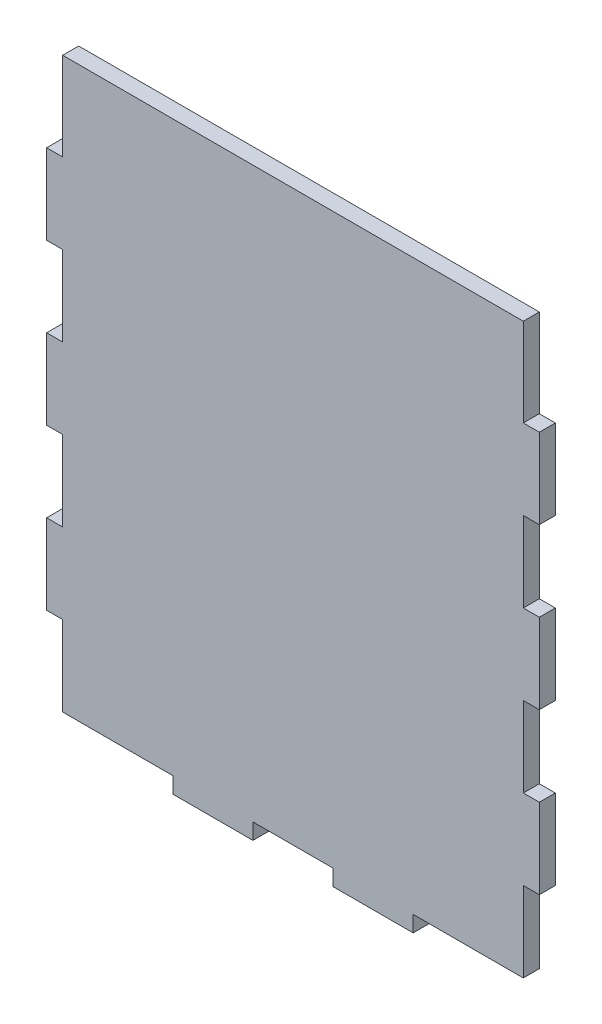
ISO-10303-21;
HEADER;
FILE_DESCRIPTION(('STEP AP214'),'2;1');
FILE_NAME('part.step','',(''),(''),'','','');
FILE_SCHEMA(('AUTOMOTIVE_DESIGN { 1 0 10303 214 1 1 1 1 }'));
ENDSEC;
DATA;
#1=APPLICATION_CONTEXT('core data for automotive mechanical design processes');
#2=APPLICATION_PROTOCOL_DEFINITION('international standard','automotive_design',2000,#1);
#3=PRODUCT_CONTEXT('',#1,'mechanical');
#4=PRODUCT('Part','Part','',(#3));
#5=PRODUCT_RELATED_PRODUCT_CATEGORY('part','',(#4));
#6=PRODUCT_DEFINITION_FORMATION('','',#4);
#7=PRODUCT_DEFINITION_CONTEXT('part definition',#1,'design');
#8=PRODUCT_DEFINITION('design','',#6,#7);
#9=PRODUCT_DEFINITION_SHAPE('','',#8);
#10=(LENGTH_UNIT() NAMED_UNIT(*) SI_UNIT(.MILLI.,.METRE.));
#11=(NAMED_UNIT(*) PLANE_ANGLE_UNIT() SI_UNIT($,.RADIAN.));
#12=(NAMED_UNIT(*) SI_UNIT($,.STERADIAN.) SOLID_ANGLE_UNIT());
#13=UNCERTAINTY_MEASURE_WITH_UNIT(LENGTH_MEASURE(1.E-05),#10,'distance_accuracy_value','');
#14=(GEOMETRIC_REPRESENTATION_CONTEXT(3) GLOBAL_UNCERTAINTY_ASSIGNED_CONTEXT((#13)) GLOBAL_UNIT_ASSIGNED_CONTEXT((#10,
#11,#12)) REPRESENTATION_CONTEXT('',''));
#15=CARTESIAN_POINT('',(0.,0.,0.));
#16=DIRECTION('',(0.,0.,1.));
#17=DIRECTION('',(1.,0.,0.));
#18=AXIS2_PLACEMENT_3D('',#15,#16,#17);
#19=CARTESIAN_POINT('',(0.,0.,4.));
#20=DIRECTION('',(1.,0.,0.));
#21=DIRECTION('',(0.,0.,-1.));
#22=AXIS2_PLACEMENT_3D('',#19,#20,#21);
#23=PLANE('',#22);
#24=DIRECTION('',(0.,-1.,0.));
#25=VECTOR('',#24,1.);
#26=CARTESIAN_POINT('',(0.,0.,0.));
#27=LINE('',#26,#25);
#28=CARTESIAN_POINT('',(0.,20.,0.));
#29=VERTEX_POINT('',#28);
#30=CARTESIAN_POINT('',(0.,0.,0.));
#31=VERTEX_POINT('',#30);
#32=EDGE_CURVE('E308',#29,#31,#27,.T.);
#33=ORIENTED_EDGE('',*,*,#32,.T.);
#34=DIRECTION('',(0.,0.,-1.));
#35=VECTOR('',#34,1.);
#36=CARTESIAN_POINT('',(0.,0.,4.));
#37=LINE('',#36,#35);
#38=CARTESIAN_POINT('',(0.,0.,4.));
#39=VERTEX_POINT('',#38);
#40=EDGE_CURVE('E11',#39,#31,#37,.T.);
#41=ORIENTED_EDGE('',*,*,#40,.F.);
#42=DIRECTION('',(0.,-1.,0.));
#43=VECTOR('',#42,1.);
#44=CARTESIAN_POINT('',(0.,0.,4.));
#45=LINE('',#44,#43);
#46=CARTESIAN_POINT('',(0.,20.,4.));
#47=VERTEX_POINT('',#46);
#48=EDGE_CURVE('E414',#47,#39,#45,.T.);
#49=ORIENTED_EDGE('',*,*,#48,.F.);
#50=DIRECTION('',(0.,0.,-1.));
#51=VECTOR('',#50,1.);
#52=CARTESIAN_POINT('',(0.,20.,4.));
#53=LINE('',#52,#51);
#54=EDGE_CURVE('E304',#47,#29,#53,.T.);
#55=ORIENTED_EDGE('',*,*,#54,.T.);
#56=EDGE_LOOP('',(#33,#41,#49,#55));
#57=FACE_BOUND('',#56,.T.);
#58=ADVANCED_FACE('F39',(#57),#23,.F.);
#59=CARTESIAN_POINT('',(0.,0.,4.));
#60=DIRECTION('',(0.,1.,0.));
#61=DIRECTION('',(0.,0.,1.));
#62=AXIS2_PLACEMENT_3D('',#59,#60,#61);
#63=PLANE('',#62);
#64=DIRECTION('',(1.,0.,0.));
#65=VECTOR('',#64,1.);
#66=CARTESIAN_POINT('',(0.,0.,0.));
#67=LINE('',#66,#65);
#68=CARTESIAN_POINT('',(27.5,0.,0.));
#69=VERTEX_POINT('',#68);
#70=EDGE_CURVE('E312',#31,#69,#67,.T.);
#71=ORIENTED_EDGE('',*,*,#70,.T.);
#72=DIRECTION('',(0.,0.,-1.));
#73=VECTOR('',#72,1.);
#74=CARTESIAN_POINT('',(27.5,0.,4.));
#75=LINE('',#74,#73);
#76=CARTESIAN_POINT('',(27.5,0.,4.));
#77=VERTEX_POINT('',#76);
#78=EDGE_CURVE('E48',#77,#69,#75,.T.);
#79=ORIENTED_EDGE('',*,*,#78,.F.);
#80=DIRECTION('',(1.,0.,0.));
#81=VECTOR('',#80,1.);
#82=CARTESIAN_POINT('',(0.,0.,4.));
#83=LINE('',#82,#81);
#84=EDGE_CURVE('E183',#39,#77,#83,.T.);
#85=ORIENTED_EDGE('',*,*,#84,.F.);
#86=ORIENTED_EDGE('',*,*,#40,.T.);
#87=EDGE_LOOP('',(#71,#79,#85,#86));
#88=FACE_BOUND('',#87,.T.);
#89=ADVANCED_FACE('F676',(#88),#63,.F.);
#90=CARTESIAN_POINT('',(27.5,0.,4.));
#91=DIRECTION('',(1.,0.,0.));
#92=DIRECTION('',(0.,1.,0.));
#93=AXIS2_PLACEMENT_3D('',#90,#91,#92);
#94=PLANE('',#93);
#95=DIRECTION('',(0.,-1.,0.));
#96=VECTOR('',#95,1.);
#97=CARTESIAN_POINT('',(27.5,0.,0.));
#98=LINE('',#97,#96);
#99=CARTESIAN_POINT('',(27.5,-4.,0.));
#100=VERTEX_POINT('',#99);
#101=EDGE_CURVE('E315',#69,#100,#98,.T.);
#102=ORIENTED_EDGE('',*,*,#101,.T.);
#103=DIRECTION('',(0.,0.,-1.));
#104=VECTOR('',#103,1.);
#105=CARTESIAN_POINT('',(27.5,-4.,4.));
#106=LINE('',#105,#104);
#107=CARTESIAN_POINT('',(27.5,-4.,4.));
#108=VERTEX_POINT('',#107);
#109=EDGE_CURVE('E537',#108,#100,#106,.T.);
#110=ORIENTED_EDGE('',*,*,#109,.F.);
#111=DIRECTION('',(0.,-1.,0.));
#112=VECTOR('',#111,1.);
#113=CARTESIAN_POINT('',(27.5,0.,4.));
#114=LINE('',#113,#112);
#115=EDGE_CURVE('E547',#77,#108,#114,.T.);
#116=ORIENTED_EDGE('',*,*,#115,.F.);
#117=ORIENTED_EDGE('',*,*,#78,.T.);
#118=EDGE_LOOP('',(#102,#110,#116,#117));
#119=FACE_BOUND('',#118,.T.);
#120=ADVANCED_FACE('F545',(#119),#94,.F.);
#121=CARTESIAN_POINT('',(27.5,-4.,4.));
#122=DIRECTION('',(0.,1.,0.));
#123=DIRECTION('',(0.,0.,1.));
#124=AXIS2_PLACEMENT_3D('',#121,#122,#123);
#125=PLANE('',#124);
#126=DIRECTION('',(1.,0.,0.));
#127=VECTOR('',#126,1.);
#128=CARTESIAN_POINT('',(27.5,-4.,0.));
#129=LINE('',#128,#127);
#130=CARTESIAN_POINT('',(47.5,-4.,0.));
#131=VERTEX_POINT('',#130);
#132=EDGE_CURVE('E318',#100,#131,#129,.T.);
#133=ORIENTED_EDGE('',*,*,#132,.T.);
#134=DIRECTION('',(0.,0.,-1.));
#135=VECTOR('',#134,1.);
#136=CARTESIAN_POINT('',(47.5,-4.,4.));
#137=LINE('',#136,#135);
#138=CARTESIAN_POINT('',(47.5,-4.,4.));
#139=VERTEX_POINT('',#138);
#140=EDGE_CURVE('E533',#139,#131,#137,.T.);
#141=ORIENTED_EDGE('',*,*,#140,.F.);
#142=DIRECTION('',(1.,0.,0.));
#143=VECTOR('',#142,1.);
#144=CARTESIAN_POINT('',(27.5,-4.,4.));
#145=LINE('',#144,#143);
#146=EDGE_CURVE('E566',#108,#139,#145,.T.);
#147=ORIENTED_EDGE('',*,*,#146,.F.);
#148=ORIENTED_EDGE('',*,*,#109,.T.);
#149=EDGE_LOOP('',(#133,#141,#147,#148));
#150=FACE_BOUND('',#149,.T.);
#151=ADVANCED_FACE('F556',(#150),#125,.F.);
#152=CARTESIAN_POINT('',(47.5,-4.,4.));
#153=DIRECTION('',(-1.,0.,0.));
#154=DIRECTION('',(0.,0.,1.));
#155=AXIS2_PLACEMENT_3D('',#152,#153,#154);
#156=PLANE('',#155);
#157=DIRECTION('',(0.,1.,0.));
#158=VECTOR('',#157,1.);
#159=CARTESIAN_POINT('',(47.5,-4.,0.));
#160=LINE('',#159,#158);
#161=CARTESIAN_POINT('',(47.5,0.,0.));
#162=VERTEX_POINT('',#161);
#163=EDGE_CURVE('E321',#131,#162,#160,.T.);
#164=ORIENTED_EDGE('',*,*,#163,.T.);
#165=DIRECTION('',(0.,0.,-1.));
#166=VECTOR('',#165,1.);
#167=CARTESIAN_POINT('',(47.5,0.,4.));
#168=LINE('',#167,#166);
#169=CARTESIAN_POINT('',(47.5,0.,4.));
#170=VERTEX_POINT('',#169);
#171=EDGE_CURVE('E529',#170,#162,#168,.T.);
#172=ORIENTED_EDGE('',*,*,#171,.F.);
#173=DIRECTION('',(0.,1.,0.));
#174=VECTOR('',#173,1.);
#175=CARTESIAN_POINT('',(47.5,-4.,4.));
#176=LINE('',#175,#174);
#177=EDGE_CURVE('E562',#139,#170,#176,.T.);
#178=ORIENTED_EDGE('',*,*,#177,.F.);
#179=ORIENTED_EDGE('',*,*,#140,.T.);
#180=EDGE_LOOP('',(#164,#172,#178,#179));
#181=FACE_BOUND('',#180,.T.);
#182=ADVANCED_FACE('F560',(#181),#156,.F.);
#183=CARTESIAN_POINT('',(47.5,0.,4.));
#184=DIRECTION('',(0.,1.,0.));
#185=DIRECTION('',(0.,0.,1.));
#186=AXIS2_PLACEMENT_3D('',#183,#184,#185);
#187=PLANE('',#186);
#188=DIRECTION('',(1.,0.,0.));
#189=VECTOR('',#188,1.);
#190=CARTESIAN_POINT('',(47.5,0.,0.));
#191=LINE('',#190,#189);
#192=CARTESIAN_POINT('',(67.5,0.,0.));
#193=VERTEX_POINT('',#192);
#194=EDGE_CURVE('E324',#162,#193,#191,.T.);
#195=ORIENTED_EDGE('',*,*,#194,.T.);
#196=DIRECTION('',(0.,0.,-1.));
#197=VECTOR('',#196,1.);
#198=CARTESIAN_POINT('',(67.5,0.,4.));
#199=LINE('',#198,#197);
#200=CARTESIAN_POINT('',(67.5,0.,4.));
#201=VERTEX_POINT('',#200);
#202=EDGE_CURVE('E525',#201,#193,#199,.T.);
#203=ORIENTED_EDGE('',*,*,#202,.F.);
#204=DIRECTION('',(1.,0.,0.));
#205=VECTOR('',#204,1.);
#206=CARTESIAN_POINT('',(47.5,0.,4.));
#207=LINE('',#206,#205);
#208=EDGE_CURVE('E565',#170,#201,#207,.T.);
#209=ORIENTED_EDGE('',*,*,#208,.F.);
#210=ORIENTED_EDGE('',*,*,#171,.T.);
#211=EDGE_LOOP('',(#195,#203,#209,#210));
#212=FACE_BOUND('',#211,.T.);
#213=ADVANCED_FACE('F689',(#212),#187,.F.);
#214=CARTESIAN_POINT('',(67.5,-4.,4.));
#215=DIRECTION('',(1.,0.,0.));
#216=DIRECTION('',(0.,0.,-1.));
#217=AXIS2_PLACEMENT_3D('',#214,#215,#216);
#218=PLANE('',#217);
#219=DIRECTION('',(0.,-1.,0.));
#220=VECTOR('',#219,1.);
#221=CARTESIAN_POINT('',(67.5,-4.,0.));
#222=LINE('',#221,#220);
#223=CARTESIAN_POINT('',(67.5,-4.,0.));
#224=VERTEX_POINT('',#223);
#225=EDGE_CURVE('E327',#193,#224,#222,.T.);
#226=ORIENTED_EDGE('',*,*,#225,.T.);
#227=DIRECTION('',(0.,0.,-1.));
#228=VECTOR('',#227,1.);
#229=CARTESIAN_POINT('',(67.5,-4.,4.));
#230=LINE('',#229,#228);
#231=CARTESIAN_POINT('',(67.5,-4.,4.));
#232=VERTEX_POINT('',#231);
#233=EDGE_CURVE('E521',#232,#224,#230,.T.);
#234=ORIENTED_EDGE('',*,*,#233,.F.);
#235=DIRECTION('',(0.,-1.,0.));
#236=VECTOR('',#235,1.);
#237=CARTESIAN_POINT('',(67.5,-4.,4.));
#238=LINE('',#237,#236);
#239=EDGE_CURVE('E570',#201,#232,#238,.T.);
#240=ORIENTED_EDGE('',*,*,#239,.F.);
#241=ORIENTED_EDGE('',*,*,#202,.T.);
#242=EDGE_LOOP('',(#226,#234,#240,#241));
#243=FACE_BOUND('',#242,.T.);
#244=ADVANCED_FACE('F692',(#243),#218,.F.);
#245=CARTESIAN_POINT('',(87.5,-4.,4.));
#246=DIRECTION('',(0.,1.,0.));
#247=DIRECTION('',(0.,0.,1.));
#248=AXIS2_PLACEMENT_3D('',#245,#246,#247);
#249=PLANE('',#248);
#250=DIRECTION('',(1.,0.,0.));
#251=VECTOR('',#250,1.);
#252=CARTESIAN_POINT('',(87.5,-4.,0.));
#253=LINE('',#252,#251);
#254=CARTESIAN_POINT('',(87.5,-4.,0.));
#255=VERTEX_POINT('',#254);
#256=EDGE_CURVE('E330',#224,#255,#253,.T.);
#257=ORIENTED_EDGE('',*,*,#256,.T.);
#258=DIRECTION('',(0.,0.,-1.));
#259=VECTOR('',#258,1.);
#260=CARTESIAN_POINT('',(87.5,-4.,4.));
#261=LINE('',#260,#259);
#262=CARTESIAN_POINT('',(87.5,-4.,4.));
#263=VERTEX_POINT('',#262);
#264=EDGE_CURVE('E517',#263,#255,#261,.T.);
#265=ORIENTED_EDGE('',*,*,#264,.F.);
#266=DIRECTION('',(1.,0.,0.));
#267=VECTOR('',#266,1.);
#268=CARTESIAN_POINT('',(87.5,-4.,4.));
#269=LINE('',#268,#267);
#270=EDGE_CURVE('E577',#232,#263,#269,.T.);
#271=ORIENTED_EDGE('',*,*,#270,.F.);
#272=ORIENTED_EDGE('',*,*,#233,.T.);
#273=EDGE_LOOP('',(#257,#265,#271,#272));
#274=FACE_BOUND('',#273,.T.);
#275=ADVANCED_FACE('F696',(#274),#249,.F.);
#276=CARTESIAN_POINT('',(87.5,0.,4.));
#277=DIRECTION('',(-1.,0.,0.));
#278=DIRECTION('',(0.,0.,1.));
#279=AXIS2_PLACEMENT_3D('',#276,#277,#278);
#280=PLANE('',#279);
#281=DIRECTION('',(0.,1.,0.));
#282=VECTOR('',#281,1.);
#283=CARTESIAN_POINT('',(87.5,0.,0.));
#284=LINE('',#283,#282);
#285=CARTESIAN_POINT('',(87.5,0.,0.));
#286=VERTEX_POINT('',#285);
#287=EDGE_CURVE('E333',#255,#286,#284,.T.);
#288=ORIENTED_EDGE('',*,*,#287,.T.);
#289=DIRECTION('',(0.,0.,-1.));
#290=VECTOR('',#289,1.);
#291=CARTESIAN_POINT('',(87.5,0.,4.));
#292=LINE('',#291,#290);
#293=CARTESIAN_POINT('',(87.5,0.,4.));
#294=VERTEX_POINT('',#293);
#295=EDGE_CURVE('E513',#294,#286,#292,.T.);
#296=ORIENTED_EDGE('',*,*,#295,.F.);
#297=DIRECTION('',(0.,1.,0.));
#298=VECTOR('',#297,1.);
#299=CARTESIAN_POINT('',(87.5,0.,4.));
#300=LINE('',#299,#298);
#301=EDGE_CURVE('E580',#263,#294,#300,.T.);
#302=ORIENTED_EDGE('',*,*,#301,.F.);
#303=ORIENTED_EDGE('',*,*,#264,.T.);
#304=EDGE_LOOP('',(#288,#296,#302,#303));
#305=FACE_BOUND('',#304,.T.);
#306=ADVANCED_FACE('F700',(#305),#280,.F.);
#307=CARTESIAN_POINT('',(87.5,0.,4.));
#308=DIRECTION('',(0.,1.,0.));
#309=DIRECTION('',(0.,0.,1.));
#310=AXIS2_PLACEMENT_3D('',#307,#308,#309);
#311=PLANE('',#310);
#312=DIRECTION('',(1.,0.,0.));
#313=VECTOR('',#312,1.);
#314=CARTESIAN_POINT('',(87.5,0.,0.));
#315=LINE('',#314,#313);
#316=CARTESIAN_POINT('',(115.,0.,0.));
#317=VERTEX_POINT('',#316);
#318=EDGE_CURVE('E336',#286,#317,#315,.T.);
#319=ORIENTED_EDGE('',*,*,#318,.T.);
#320=DIRECTION('',(0.,0.,-1.));
#321=VECTOR('',#320,1.);
#322=CARTESIAN_POINT('',(115.,0.,4.));
#323=LINE('',#322,#321);
#324=CARTESIAN_POINT('',(115.,0.,4.));
#325=VERTEX_POINT('',#324);
#326=EDGE_CURVE('E509',#325,#317,#323,.T.);
#327=ORIENTED_EDGE('',*,*,#326,.F.);
#328=DIRECTION('',(1.,0.,0.));
#329=VECTOR('',#328,1.);
#330=CARTESIAN_POINT('',(87.5,0.,4.));
#331=LINE('',#330,#329);
#332=EDGE_CURVE('E583',#294,#325,#331,.T.);
#333=ORIENTED_EDGE('',*,*,#332,.F.);
#334=ORIENTED_EDGE('',*,*,#295,.T.);
#335=EDGE_LOOP('',(#319,#327,#333,#334));
#336=FACE_BOUND('',#335,.T.);
#337=ADVANCED_FACE('F704',(#336),#311,.F.);
#338=CARTESIAN_POINT('',(115.,0.,4.));
#339=DIRECTION('',(-1.,0.,0.));
#340=DIRECTION('',(0.,0.,1.));
#341=AXIS2_PLACEMENT_3D('',#338,#339,#340);
#342=PLANE('',#341);
#343=DIRECTION('',(0.,1.,0.));
#344=VECTOR('',#343,1.);
#345=CARTESIAN_POINT('',(115.,0.,0.));
#346=LINE('',#345,#344);
#347=CARTESIAN_POINT('',(115.,20.,0.));
#348=VERTEX_POINT('',#347);
#349=EDGE_CURVE('E339',#317,#348,#346,.T.);
#350=ORIENTED_EDGE('',*,*,#349,.T.);
#351=DIRECTION('',(0.,0.,-1.));
#352=VECTOR('',#351,1.);
#353=CARTESIAN_POINT('',(115.,20.,4.));
#354=LINE('',#353,#352);
#355=CARTESIAN_POINT('',(115.,20.,4.));
#356=VERTEX_POINT('',#355);
#357=EDGE_CURVE('E505',#356,#348,#354,.T.);
#358=ORIENTED_EDGE('',*,*,#357,.F.);
#359=DIRECTION('',(0.,1.,0.));
#360=VECTOR('',#359,1.);
#361=CARTESIAN_POINT('',(115.,0.,4.));
#362=LINE('',#361,#360);
#363=EDGE_CURVE('E586',#325,#356,#362,.T.);
#364=ORIENTED_EDGE('',*,*,#363,.F.);
#365=ORIENTED_EDGE('',*,*,#326,.T.);
#366=EDGE_LOOP('',(#350,#358,#364,#365));
#367=FACE_BOUND('',#366,.T.);
#368=ADVANCED_FACE('F708',(#367),#342,.F.);
#369=CARTESIAN_POINT('',(118.999999999999,20.,4.));
#370=DIRECTION('',(0.,1.,0.));
#371=DIRECTION('',(-1.,0.,0.));
#372=AXIS2_PLACEMENT_3D('',#369,#370,#371);
#373=PLANE('',#372);
#374=DIRECTION('',(1.,0.,0.));
#375=VECTOR('',#374,1.);
#376=CARTESIAN_POINT('',(118.999999999999,20.,0.));
#377=LINE('',#376,#375);
#378=CARTESIAN_POINT('',(118.999999999999,20.,0.));
#379=VERTEX_POINT('',#378);
#380=EDGE_CURVE('E342',#348,#379,#377,.T.);
#381=ORIENTED_EDGE('',*,*,#380,.T.);
#382=DIRECTION('',(0.,0.,-1.));
#383=VECTOR('',#382,1.);
#384=CARTESIAN_POINT('',(118.999999999999,20.,4.));
#385=LINE('',#384,#383);
#386=CARTESIAN_POINT('',(118.999999999999,20.,4.));
#387=VERTEX_POINT('',#386);
#388=EDGE_CURVE('E501',#387,#379,#385,.T.);
#389=ORIENTED_EDGE('',*,*,#388,.F.);
#390=DIRECTION('',(1.,0.,0.));
#391=VECTOR('',#390,1.);
#392=CARTESIAN_POINT('',(118.999999999999,20.,4.));
#393=LINE('',#392,#391);
#394=EDGE_CURVE('E589',#356,#387,#393,.T.);
#395=ORIENTED_EDGE('',*,*,#394,.F.);
#396=ORIENTED_EDGE('',*,*,#357,.T.);
#397=EDGE_LOOP('',(#381,#389,#395,#396));
#398=FACE_BOUND('',#397,.T.);
#399=ADVANCED_FACE('F712',(#398),#373,.F.);
#400=CARTESIAN_POINT('',(118.999999999999,40.,4.));
#401=DIRECTION('',(-1.,0.,0.));
#402=DIRECTION('',(0.,0.,1.));
#403=AXIS2_PLACEMENT_3D('',#400,#401,#402);
#404=PLANE('',#403);
#405=DIRECTION('',(0.,1.,0.));
#406=VECTOR('',#405,1.);
#407=CARTESIAN_POINT('',(118.999999999999,40.,0.));
#408=LINE('',#407,#406);
#409=CARTESIAN_POINT('',(118.999999999999,40.,0.));
#410=VERTEX_POINT('',#409);
#411=EDGE_CURVE('E345',#379,#410,#408,.T.);
#412=ORIENTED_EDGE('',*,*,#411,.T.);
#413=DIRECTION('',(0.,0.,-1.));
#414=VECTOR('',#413,1.);
#415=CARTESIAN_POINT('',(118.999999999999,40.,4.));
#416=LINE('',#415,#414);
#417=CARTESIAN_POINT('',(118.999999999999,40.,4.));
#418=VERTEX_POINT('',#417);
#419=EDGE_CURVE('E497',#418,#410,#416,.T.);
#420=ORIENTED_EDGE('',*,*,#419,.F.);
#421=DIRECTION('',(0.,1.,0.));
#422=VECTOR('',#421,1.);
#423=CARTESIAN_POINT('',(118.999999999999,40.,4.));
#424=LINE('',#423,#422);
#425=EDGE_CURVE('E592',#387,#418,#424,.T.);
#426=ORIENTED_EDGE('',*,*,#425,.F.);
#427=ORIENTED_EDGE('',*,*,#388,.T.);
#428=EDGE_LOOP('',(#412,#420,#426,#427));
#429=FACE_BOUND('',#428,.T.);
#430=ADVANCED_FACE('F716',(#429),#404,.F.);
#431=CARTESIAN_POINT('',(114.999999999999,40.,4.));
#432=DIRECTION('',(0.,-1.,0.));
#433=DIRECTION('',(0.,0.,-1.));
#434=AXIS2_PLACEMENT_3D('',#431,#432,#433);
#435=PLANE('',#434);
#436=DIRECTION('',(-1.,0.,0.));
#437=VECTOR('',#436,1.);
#438=CARTESIAN_POINT('',(114.999999999999,40.,0.));
#439=LINE('',#438,#437);
#440=CARTESIAN_POINT('',(114.999999999999,40.,0.));
#441=VERTEX_POINT('',#440);
#442=EDGE_CURVE('E348',#410,#441,#439,.T.);
#443=ORIENTED_EDGE('',*,*,#442,.T.);
#444=DIRECTION('',(0.,0.,-1.));
#445=VECTOR('',#444,1.);
#446=CARTESIAN_POINT('',(114.999999999999,40.,4.));
#447=LINE('',#446,#445);
#448=CARTESIAN_POINT('',(114.999999999999,40.,4.));
#449=VERTEX_POINT('',#448);
#450=EDGE_CURVE('E493',#449,#441,#447,.T.);
#451=ORIENTED_EDGE('',*,*,#450,.F.);
#452=DIRECTION('',(-1.,0.,0.));
#453=VECTOR('',#452,1.);
#454=CARTESIAN_POINT('',(114.999999999999,40.,4.));
#455=LINE('',#454,#453);
#456=EDGE_CURVE('E595',#418,#449,#455,.T.);
#457=ORIENTED_EDGE('',*,*,#456,.F.);
#458=ORIENTED_EDGE('',*,*,#419,.T.);
#459=EDGE_LOOP('',(#443,#451,#457,#458));
#460=FACE_BOUND('',#459,.T.);
#461=ADVANCED_FACE('F720',(#460),#435,.F.);
#462=CARTESIAN_POINT('',(114.999999999999,40.,4.));
#463=DIRECTION('',(-1.,0.,0.));
#464=DIRECTION('',(0.,-1.,0.));
#465=AXIS2_PLACEMENT_3D('',#462,#463,#464);
#466=PLANE('',#465);
#467=DIRECTION('',(0.,1.,0.));
#468=VECTOR('',#467,1.);
#469=CARTESIAN_POINT('',(114.999999999999,40.,0.));
#470=LINE('',#469,#468);
#471=CARTESIAN_POINT('',(114.999999999999,60.,0.));
#472=VERTEX_POINT('',#471);
#473=EDGE_CURVE('E351',#441,#472,#470,.T.);
#474=ORIENTED_EDGE('',*,*,#473,.T.);
#475=DIRECTION('',(0.,0.,-1.));
#476=VECTOR('',#475,1.);
#477=CARTESIAN_POINT('',(114.999999999999,60.,4.));
#478=LINE('',#477,#476);
#479=CARTESIAN_POINT('',(114.999999999999,60.,4.));
#480=VERTEX_POINT('',#479);
#481=EDGE_CURVE('E489',#480,#472,#478,.T.);
#482=ORIENTED_EDGE('',*,*,#481,.F.);
#483=DIRECTION('',(0.,1.,0.));
#484=VECTOR('',#483,1.);
#485=CARTESIAN_POINT('',(114.999999999999,40.,4.));
#486=LINE('',#485,#484);
#487=EDGE_CURVE('E598',#449,#480,#486,.T.);
#488=ORIENTED_EDGE('',*,*,#487,.F.);
#489=ORIENTED_EDGE('',*,*,#450,.T.);
#490=EDGE_LOOP('',(#474,#482,#488,#489));
#491=FACE_BOUND('',#490,.T.);
#492=ADVANCED_FACE('F724',(#491),#466,.F.);
#493=CARTESIAN_POINT('',(118.999999999999,60.0000000000013,4.));
#494=DIRECTION('',(-3.19189119579733E-13,1.,0.));
#495=DIRECTION('',(-1.,-3.19189119579733E-13,0.));
#496=AXIS2_PLACEMENT_3D('',#493,#494,#495);
#497=PLANE('',#496);
#498=DIRECTION('',(1.,3.19189119579733E-13,0.));
#499=VECTOR('',#498,1.);
#500=CARTESIAN_POINT('',(118.999999999999,60.0000000000013,0.));
#501=LINE('',#500,#499);
#502=CARTESIAN_POINT('',(118.999999999999,60.0000000000013,0.));
#503=VERTEX_POINT('',#502);
#504=EDGE_CURVE('E354',#472,#503,#501,.T.);
#505=ORIENTED_EDGE('',*,*,#504,.T.);
#506=DIRECTION('',(0.,0.,-1.));
#507=VECTOR('',#506,1.);
#508=CARTESIAN_POINT('',(118.999999999999,60.0000000000013,4.));
#509=LINE('',#508,#507);
#510=CARTESIAN_POINT('',(118.999999999999,60.0000000000013,4.));
#511=VERTEX_POINT('',#510);
#512=EDGE_CURVE('E485',#511,#503,#509,.T.);
#513=ORIENTED_EDGE('',*,*,#512,.F.);
#514=DIRECTION('',(1.,3.19189119579733E-13,0.));
#515=VECTOR('',#514,1.);
#516=CARTESIAN_POINT('',(118.999999999999,60.0000000000013,4.));
#517=LINE('',#516,#515);
#518=EDGE_CURVE('E601',#480,#511,#517,.T.);
#519=ORIENTED_EDGE('',*,*,#518,.F.);
#520=ORIENTED_EDGE('',*,*,#481,.T.);
#521=EDGE_LOOP('',(#505,#513,#519,#520));
#522=FACE_BOUND('',#521,.T.);
#523=ADVANCED_FACE('F728',(#522),#497,.F.);
#524=CARTESIAN_POINT('',(118.999999999998,80.0000000000013,4.));
#525=DIRECTION('',(-1.,0.,0.));
#526=DIRECTION('',(0.,-1.,0.));
#527=AXIS2_PLACEMENT_3D('',#524,#525,#526);
#528=PLANE('',#527);
#529=DIRECTION('',(0.,1.,0.));
#530=VECTOR('',#529,1.);
#531=CARTESIAN_POINT('',(118.999999999998,80.0000000000013,0.));
#532=LINE('',#531,#530);
#533=CARTESIAN_POINT('',(118.999999999998,80.0000000000013,0.));
#534=VERTEX_POINT('',#533);
#535=EDGE_CURVE('E357',#503,#534,#532,.T.);
#536=ORIENTED_EDGE('',*,*,#535,.T.);
#537=DIRECTION('',(0.,0.,-1.));
#538=VECTOR('',#537,1.);
#539=CARTESIAN_POINT('',(118.999999999998,80.0000000000013,4.));
#540=LINE('',#539,#538);
#541=CARTESIAN_POINT('',(118.999999999998,80.0000000000013,4.));
#542=VERTEX_POINT('',#541);
#543=EDGE_CURVE('E481',#542,#534,#540,.T.);
#544=ORIENTED_EDGE('',*,*,#543,.F.);
#545=DIRECTION('',(0.,1.,0.));
#546=VECTOR('',#545,1.);
#547=CARTESIAN_POINT('',(118.999999999998,80.0000000000013,4.));
#548=LINE('',#547,#546);
#549=EDGE_CURVE('E604',#511,#542,#548,.T.);
#550=ORIENTED_EDGE('',*,*,#549,.F.);
#551=ORIENTED_EDGE('',*,*,#512,.T.);
#552=EDGE_LOOP('',(#536,#544,#550,#551));
#553=FACE_BOUND('',#552,.T.);
#554=ADVANCED_FACE('F732',(#553),#528,.F.);
#555=CARTESIAN_POINT('',(114.999999999998,80.0000000000012,4.));
#556=DIRECTION('',(0.,-1.,0.));
#557=DIRECTION('',(1.,0.,0.));
#558=AXIS2_PLACEMENT_3D('',#555,#556,#557);
#559=PLANE('',#558);
#560=DIRECTION('',(-1.,0.,0.));
#561=VECTOR('',#560,1.);
#562=CARTESIAN_POINT('',(114.999999999998,80.0000000000012,0.));
#563=LINE('',#562,#561);
#564=CARTESIAN_POINT('',(114.999999999998,80.0000000000012,0.));
#565=VERTEX_POINT('',#564);
#566=EDGE_CURVE('E360',#534,#565,#563,.T.);
#567=ORIENTED_EDGE('',*,*,#566,.T.);
#568=DIRECTION('',(0.,0.,-1.));
#569=VECTOR('',#568,1.);
#570=CARTESIAN_POINT('',(114.999999999998,80.0000000000012,4.));
#571=LINE('',#570,#569);
#572=CARTESIAN_POINT('',(114.999999999998,80.0000000000012,4.));
#573=VERTEX_POINT('',#572);
#574=EDGE_CURVE('E477',#573,#565,#571,.T.);
#575=ORIENTED_EDGE('',*,*,#574,.F.);
#576=DIRECTION('',(-1.,0.,0.));
#577=VECTOR('',#576,1.);
#578=CARTESIAN_POINT('',(114.999999999998,80.0000000000012,4.));
#579=LINE('',#578,#577);
#580=EDGE_CURVE('E607',#542,#573,#579,.T.);
#581=ORIENTED_EDGE('',*,*,#580,.F.);
#582=ORIENTED_EDGE('',*,*,#543,.T.);
#583=EDGE_LOOP('',(#567,#575,#581,#582));
#584=FACE_BOUND('',#583,.T.);
#585=ADVANCED_FACE('F736',(#584),#559,.F.);
#586=CARTESIAN_POINT('',(114.999999999998,80.0000000000012,4.));
#587=DIRECTION('',(-1.,0.,0.));
#588=DIRECTION('',(0.,-1.,0.));
#589=AXIS2_PLACEMENT_3D('',#586,#587,#588);
#590=PLANE('',#589);
#591=DIRECTION('',(0.,1.,0.));
#592=VECTOR('',#591,1.);
#593=CARTESIAN_POINT('',(114.999999999998,80.0000000000012,0.));
#594=LINE('',#593,#592);
#595=CARTESIAN_POINT('',(114.999999999998,100.,0.));
#596=VERTEX_POINT('',#595);
#597=EDGE_CURVE('E363',#565,#596,#594,.T.);
#598=ORIENTED_EDGE('',*,*,#597,.T.);
#599=DIRECTION('',(0.,0.,-1.));
#600=VECTOR('',#599,1.);
#601=CARTESIAN_POINT('',(114.999999999998,100.,4.));
#602=LINE('',#601,#600);
#603=CARTESIAN_POINT('',(114.999999999998,100.,4.));
#604=VERTEX_POINT('',#603);
#605=EDGE_CURVE('E473',#604,#596,#602,.T.);
#606=ORIENTED_EDGE('',*,*,#605,.F.);
#607=DIRECTION('',(0.,1.,0.));
#608=VECTOR('',#607,1.);
#609=CARTESIAN_POINT('',(114.999999999998,80.0000000000012,4.));
#610=LINE('',#609,#608);
#611=EDGE_CURVE('E610',#573,#604,#610,.T.);
#612=ORIENTED_EDGE('',*,*,#611,.F.);
#613=ORIENTED_EDGE('',*,*,#574,.T.);
#614=EDGE_LOOP('',(#598,#606,#612,#613));
#615=FACE_BOUND('',#614,.T.);
#616=ADVANCED_FACE('F740',(#615),#590,.F.);
#617=CARTESIAN_POINT('',(118.999999999998,100.000000000001,4.));
#618=DIRECTION('',(-3.19189119579733E-13,1.,0.));
#619=DIRECTION('',(-1.,-3.19189119579733E-13,0.));
#620=AXIS2_PLACEMENT_3D('',#617,#618,#619);
#621=PLANE('',#620);
#622=DIRECTION('',(1.,3.19189119579733E-13,0.));
#623=VECTOR('',#622,1.);
#624=CARTESIAN_POINT('',(118.999999999998,100.000000000001,0.));
#625=LINE('',#624,#623);
#626=CARTESIAN_POINT('',(118.999999999998,100.000000000001,0.));
#627=VERTEX_POINT('',#626);
#628=EDGE_CURVE('E366',#596,#627,#625,.T.);
#629=ORIENTED_EDGE('',*,*,#628,.T.);
#630=DIRECTION('',(0.,0.,-1.));
#631=VECTOR('',#630,1.);
#632=CARTESIAN_POINT('',(118.999999999998,100.000000000001,4.));
#633=LINE('',#632,#631);
#634=CARTESIAN_POINT('',(118.999999999998,100.000000000001,4.));
#635=VERTEX_POINT('',#634);
#636=EDGE_CURVE('E469',#635,#627,#633,.T.);
#637=ORIENTED_EDGE('',*,*,#636,.F.);
#638=DIRECTION('',(1.,3.19189119579733E-13,0.));
#639=VECTOR('',#638,1.);
#640=CARTESIAN_POINT('',(118.999999999998,100.000000000001,4.));
#641=LINE('',#640,#639);
#642=EDGE_CURVE('E613',#604,#635,#641,.T.);
#643=ORIENTED_EDGE('',*,*,#642,.F.);
#644=ORIENTED_EDGE('',*,*,#605,.T.);
#645=EDGE_LOOP('',(#629,#637,#643,#644));
#646=FACE_BOUND('',#645,.T.);
#647=ADVANCED_FACE('F744',(#646),#621,.F.);
#648=CARTESIAN_POINT('',(118.999999999998,120.000000000001,4.));
#649=DIRECTION('',(-1.,0.,0.));
#650=DIRECTION('',(0.,-1.,0.));
#651=AXIS2_PLACEMENT_3D('',#648,#649,#650);
#652=PLANE('',#651);
#653=DIRECTION('',(0.,1.,0.));
#654=VECTOR('',#653,1.);
#655=CARTESIAN_POINT('',(118.999999999998,120.000000000001,0.));
#656=LINE('',#655,#654);
#657=CARTESIAN_POINT('',(118.999999999998,120.000000000001,0.));
#658=VERTEX_POINT('',#657);
#659=EDGE_CURVE('E369',#627,#658,#656,.T.);
#660=ORIENTED_EDGE('',*,*,#659,.T.);
#661=DIRECTION('',(0.,0.,-1.));
#662=VECTOR('',#661,1.);
#663=CARTESIAN_POINT('',(118.999999999998,120.000000000001,4.));
#664=LINE('',#663,#662);
#665=CARTESIAN_POINT('',(118.999999999998,120.000000000001,4.));
#666=VERTEX_POINT('',#665);
#667=EDGE_CURVE('E465',#666,#658,#664,.T.);
#668=ORIENTED_EDGE('',*,*,#667,.F.);
#669=DIRECTION('',(0.,1.,0.));
#670=VECTOR('',#669,1.);
#671=CARTESIAN_POINT('',(118.999999999998,120.000000000001,4.));
#672=LINE('',#671,#670);
#673=EDGE_CURVE('E616',#635,#666,#672,.T.);
#674=ORIENTED_EDGE('',*,*,#673,.F.);
#675=ORIENTED_EDGE('',*,*,#636,.T.);
#676=EDGE_LOOP('',(#660,#668,#674,#675));
#677=FACE_BOUND('',#676,.T.);
#678=ADVANCED_FACE('F748',(#677),#652,.F.);
#679=CARTESIAN_POINT('',(114.999999999998,120.000000000001,4.));
#680=DIRECTION('',(0.,-1.,0.));
#681=DIRECTION('',(1.,0.,0.));
#682=AXIS2_PLACEMENT_3D('',#679,#680,#681);
#683=PLANE('',#682);
#684=DIRECTION('',(-1.,0.,0.));
#685=VECTOR('',#684,1.);
#686=CARTESIAN_POINT('',(114.999999999998,120.000000000001,0.));
#687=LINE('',#686,#685);
#688=CARTESIAN_POINT('',(114.999999999998,120.000000000001,0.));
#689=VERTEX_POINT('',#688);
#690=EDGE_CURVE('E372',#658,#689,#687,.T.);
#691=ORIENTED_EDGE('',*,*,#690,.T.);
#692=DIRECTION('',(0.,0.,-1.));
#693=VECTOR('',#692,1.);
#694=CARTESIAN_POINT('',(114.999999999998,120.000000000001,4.));
#695=LINE('',#694,#693);
#696=CARTESIAN_POINT('',(114.999999999998,120.000000000001,4.));
#697=VERTEX_POINT('',#696);
#698=EDGE_CURVE('E461',#697,#689,#695,.T.);
#699=ORIENTED_EDGE('',*,*,#698,.F.);
#700=DIRECTION('',(-1.,0.,0.));
#701=VECTOR('',#700,1.);
#702=CARTESIAN_POINT('',(114.999999999998,120.000000000001,4.));
#703=LINE('',#702,#701);
#704=EDGE_CURVE('E619',#666,#697,#703,.T.);
#705=ORIENTED_EDGE('',*,*,#704,.F.);
#706=ORIENTED_EDGE('',*,*,#667,.T.);
#707=EDGE_LOOP('',(#691,#699,#705,#706));
#708=FACE_BOUND('',#707,.T.);
#709=ADVANCED_FACE('F752',(#708),#683,.F.);
#710=CARTESIAN_POINT('',(114.999999999998,120.000000000001,4.));
#711=DIRECTION('',(-1.,0.,0.));
#712=DIRECTION('',(0.,-1.,0.));
#713=AXIS2_PLACEMENT_3D('',#710,#711,#712);
#714=PLANE('',#713);
#715=DIRECTION('',(0.,1.,0.));
#716=VECTOR('',#715,1.);
#717=CARTESIAN_POINT('',(114.999999999998,120.000000000001,0.));
#718=LINE('',#717,#716);
#719=CARTESIAN_POINT('',(114.999999999999,142.000000000001,0.));
#720=VERTEX_POINT('',#719);
#721=EDGE_CURVE('E375',#689,#720,#718,.T.);
#722=ORIENTED_EDGE('',*,*,#721,.T.);
#723=DIRECTION('',(0.,0.,-1.));
#724=VECTOR('',#723,1.);
#725=CARTESIAN_POINT('',(114.999999999999,142.000000000001,4.));
#726=LINE('',#725,#724);
#727=CARTESIAN_POINT('',(114.999999999999,142.000000000001,4.));
#728=VERTEX_POINT('',#727);
#729=EDGE_CURVE('E457',#728,#720,#726,.T.);
#730=ORIENTED_EDGE('',*,*,#729,.F.);
#731=DIRECTION('',(0.,1.,0.));
#732=VECTOR('',#731,1.);
#733=CARTESIAN_POINT('',(114.999999999998,120.000000000001,4.));
#734=LINE('',#733,#732);
#735=EDGE_CURVE('E622',#697,#728,#734,.T.);
#736=ORIENTED_EDGE('',*,*,#735,.F.);
#737=ORIENTED_EDGE('',*,*,#698,.T.);
#738=EDGE_LOOP('',(#722,#730,#736,#737));
#739=FACE_BOUND('',#738,.T.);
#740=ADVANCED_FACE('F756',(#739),#714,.F.);
#741=CARTESIAN_POINT('',(-1.46998106579928E-12,142.,4.));
#742=DIRECTION('',(0.,-1.,0.));
#743=DIRECTION('',(1.,0.,0.));
#744=AXIS2_PLACEMENT_3D('',#741,#742,#743);
#745=PLANE('',#744);
#746=DIRECTION('',(-1.,0.,0.));
#747=VECTOR('',#746,1.);
#748=CARTESIAN_POINT('',(-1.46998106579928E-12,142.,0.));
#749=LINE('',#748,#747);
#750=CARTESIAN_POINT('',(-1.46998106579928E-12,142.,0.));
#751=VERTEX_POINT('',#750);
#752=EDGE_CURVE('E378',#720,#751,#749,.T.);
#753=ORIENTED_EDGE('',*,*,#752,.T.);
#754=DIRECTION('',(0.,0.,-1.));
#755=VECTOR('',#754,1.);
#756=CARTESIAN_POINT('',(-1.46998106579928E-12,142.,4.));
#757=LINE('',#756,#755);
#758=CARTESIAN_POINT('',(-1.46998106579928E-12,142.,4.));
#759=VERTEX_POINT('',#758);
#760=EDGE_CURVE('E453',#759,#751,#757,.T.);
#761=ORIENTED_EDGE('',*,*,#760,.F.);
#762=DIRECTION('',(-1.,0.,0.));
#763=VECTOR('',#762,1.);
#764=CARTESIAN_POINT('',(-1.46998106579928E-12,142.,4.));
#765=LINE('',#764,#763);
#766=EDGE_CURVE('E625',#728,#759,#765,.T.);
#767=ORIENTED_EDGE('',*,*,#766,.F.);
#768=ORIENTED_EDGE('',*,*,#729,.T.);
#769=EDGE_LOOP('',(#753,#761,#767,#768));
#770=FACE_BOUND('',#769,.T.);
#771=ADVANCED_FACE('F760',(#770),#745,.F.);
#772=CARTESIAN_POINT('',(0.,120.,4.));
#773=DIRECTION('',(1.,0.,0.));
#774=DIRECTION('',(0.,1.,0.));
#775=AXIS2_PLACEMENT_3D('',#772,#773,#774);
#776=PLANE('',#775);
#777=DIRECTION('',(0.,-1.,0.));
#778=VECTOR('',#777,1.);
#779=CARTESIAN_POINT('',(0.,120.,0.));
#780=LINE('',#779,#778);
#781=CARTESIAN_POINT('',(0.,120.,0.));
#782=VERTEX_POINT('',#781);
#783=EDGE_CURVE('E381',#751,#782,#780,.T.);
#784=ORIENTED_EDGE('',*,*,#783,.T.);
#785=DIRECTION('',(0.,0.,-1.));
#786=VECTOR('',#785,1.);
#787=CARTESIAN_POINT('',(0.,120.,4.));
#788=LINE('',#787,#786);
#789=CARTESIAN_POINT('',(0.,120.,4.));
#790=VERTEX_POINT('',#789);
#791=EDGE_CURVE('E449',#790,#782,#788,.T.);
#792=ORIENTED_EDGE('',*,*,#791,.F.);
#793=DIRECTION('',(0.,-1.,0.));
#794=VECTOR('',#793,1.);
#795=CARTESIAN_POINT('',(0.,120.,4.));
#796=LINE('',#795,#794);
#797=EDGE_CURVE('E628',#759,#790,#796,.T.);
#798=ORIENTED_EDGE('',*,*,#797,.F.);
#799=ORIENTED_EDGE('',*,*,#760,.T.);
#800=EDGE_LOOP('',(#784,#792,#798,#799));
#801=FACE_BOUND('',#800,.T.);
#802=ADVANCED_FACE('F764',(#801),#776,.F.);
#803=CARTESIAN_POINT('',(0.,120.,4.));
#804=DIRECTION('',(0.,-1.,0.));
#805=DIRECTION('',(0.,0.,-1.));
#806=AXIS2_PLACEMENT_3D('',#803,#804,#805);
#807=PLANE('',#806);
#808=DIRECTION('',(-1.,0.,0.));
#809=VECTOR('',#808,1.);
#810=CARTESIAN_POINT('',(0.,120.,0.));
#811=LINE('',#810,#809);
#812=CARTESIAN_POINT('',(-4.,120.,0.));
#813=VERTEX_POINT('',#812);
#814=EDGE_CURVE('E384',#782,#813,#811,.T.);
#815=ORIENTED_EDGE('',*,*,#814,.T.);
#816=DIRECTION('',(0.,0.,-1.));
#817=VECTOR('',#816,1.);
#818=CARTESIAN_POINT('',(-4.,120.,4.));
#819=LINE('',#818,#817);
#820=CARTESIAN_POINT('',(-4.,120.,4.));
#821=VERTEX_POINT('',#820);
#822=EDGE_CURVE('E445',#821,#813,#819,.T.);
#823=ORIENTED_EDGE('',*,*,#822,.F.);
#824=DIRECTION('',(-1.,0.,0.));
#825=VECTOR('',#824,1.);
#826=CARTESIAN_POINT('',(0.,120.,4.));
#827=LINE('',#826,#825);
#828=EDGE_CURVE('E631',#790,#821,#827,.T.);
#829=ORIENTED_EDGE('',*,*,#828,.F.);
#830=ORIENTED_EDGE('',*,*,#791,.T.);
#831=EDGE_LOOP('',(#815,#823,#829,#830));
#832=FACE_BOUND('',#831,.T.);
#833=ADVANCED_FACE('F768',(#832),#807,.F.);
#834=CARTESIAN_POINT('',(-4.,120.,4.));
#835=DIRECTION('',(1.,0.,0.));
#836=DIRECTION('',(0.,0.,-1.));
#837=AXIS2_PLACEMENT_3D('',#834,#835,#836);
#838=PLANE('',#837);
#839=DIRECTION('',(0.,-1.,0.));
#840=VECTOR('',#839,1.);
#841=CARTESIAN_POINT('',(-4.,120.,0.));
#842=LINE('',#841,#840);
#843=CARTESIAN_POINT('',(-4.,100.,0.));
#844=VERTEX_POINT('',#843);
#845=EDGE_CURVE('E387',#813,#844,#842,.T.);
#846=ORIENTED_EDGE('',*,*,#845,.T.);
#847=DIRECTION('',(0.,0.,-1.));
#848=VECTOR('',#847,1.);
#849=CARTESIAN_POINT('',(-4.,100.,4.));
#850=LINE('',#849,#848);
#851=CARTESIAN_POINT('',(-4.,100.,4.));
#852=VERTEX_POINT('',#851);
#853=EDGE_CURVE('E441',#852,#844,#850,.T.);
#854=ORIENTED_EDGE('',*,*,#853,.F.);
#855=DIRECTION('',(0.,-1.,0.));
#856=VECTOR('',#855,1.);
#857=CARTESIAN_POINT('',(-4.,120.,4.));
#858=LINE('',#857,#856);
#859=EDGE_CURVE('E634',#821,#852,#858,.T.);
#860=ORIENTED_EDGE('',*,*,#859,.F.);
#861=ORIENTED_EDGE('',*,*,#822,.T.);
#862=EDGE_LOOP('',(#846,#854,#860,#861));
#863=FACE_BOUND('',#862,.T.);
#864=ADVANCED_FACE('F772',(#863),#838,.F.);
#865=CARTESIAN_POINT('',(-4.,100.,4.));
#866=DIRECTION('',(2.98372437868011E-13,1.,0.));
#867=DIRECTION('',(-1.,2.98372437868011E-13,0.));
#868=AXIS2_PLACEMENT_3D('',#865,#866,#867);
#869=PLANE('',#868);
#870=DIRECTION('',(1.,-2.98372437868011E-13,0.));
#871=VECTOR('',#870,1.);
#872=CARTESIAN_POINT('',(-4.,100.,0.));
#873=LINE('',#872,#871);
#874=CARTESIAN_POINT('',(0.,99.9999999999988,0.));
#875=VERTEX_POINT('',#874);
#876=EDGE_CURVE('E390',#844,#875,#873,.T.);
#877=ORIENTED_EDGE('',*,*,#876,.T.);
#878=DIRECTION('',(0.,0.,-1.));
#879=VECTOR('',#878,1.);
#880=CARTESIAN_POINT('',(0.,99.9999999999988,4.));
#881=LINE('',#880,#879);
#882=CARTESIAN_POINT('',(0.,99.9999999999988,4.));
#883=VERTEX_POINT('',#882);
#884=EDGE_CURVE('E437',#883,#875,#881,.T.);
#885=ORIENTED_EDGE('',*,*,#884,.F.);
#886=DIRECTION('',(1.,-2.98372437868011E-13,0.));
#887=VECTOR('',#886,1.);
#888=CARTESIAN_POINT('',(-4.,100.,4.));
#889=LINE('',#888,#887);
#890=EDGE_CURVE('E637',#852,#883,#889,.T.);
#891=ORIENTED_EDGE('',*,*,#890,.F.);
#892=ORIENTED_EDGE('',*,*,#853,.T.);
#893=EDGE_LOOP('',(#877,#885,#891,#892));
#894=FACE_BOUND('',#893,.T.);
#895=ADVANCED_FACE('F776',(#894),#869,.F.);
#896=CARTESIAN_POINT('',(0.,80.,4.));
#897=DIRECTION('',(1.,0.,0.));
#898=DIRECTION('',(0.,0.,-1.));
#899=AXIS2_PLACEMENT_3D('',#896,#897,#898);
#900=PLANE('',#899);
#901=DIRECTION('',(0.,-1.,0.));
#902=VECTOR('',#901,1.);
#903=CARTESIAN_POINT('',(0.,80.,0.));
#904=LINE('',#903,#902);
#905=CARTESIAN_POINT('',(0.,80.,0.));
#906=VERTEX_POINT('',#905);
#907=EDGE_CURVE('E393',#875,#906,#904,.T.);
#908=ORIENTED_EDGE('',*,*,#907,.T.);
#909=DIRECTION('',(0.,0.,-1.));
#910=VECTOR('',#909,1.);
#911=CARTESIAN_POINT('',(0.,80.,4.));
#912=LINE('',#911,#910);
#913=CARTESIAN_POINT('',(0.,80.,4.));
#914=VERTEX_POINT('',#913);
#915=EDGE_CURVE('E433',#914,#906,#912,.T.);
#916=ORIENTED_EDGE('',*,*,#915,.F.);
#917=DIRECTION('',(0.,-1.,0.));
#918=VECTOR('',#917,1.);
#919=CARTESIAN_POINT('',(0.,80.,4.));
#920=LINE('',#919,#918);
#921=EDGE_CURVE('E640',#883,#914,#920,.T.);
#922=ORIENTED_EDGE('',*,*,#921,.F.);
#923=ORIENTED_EDGE('',*,*,#884,.T.);
#924=EDGE_LOOP('',(#908,#916,#922,#923));
#925=FACE_BOUND('',#924,.T.);
#926=ADVANCED_FACE('F780',(#925),#900,.F.);
#927=CARTESIAN_POINT('',(0.,80.,4.));
#928=DIRECTION('',(0.,-1.,0.));
#929=DIRECTION('',(0.,0.,-1.));
#930=AXIS2_PLACEMENT_3D('',#927,#928,#929);
#931=PLANE('',#930);
#932=DIRECTION('',(-1.,0.,0.));
#933=VECTOR('',#932,1.);
#934=CARTESIAN_POINT('',(0.,80.,0.));
#935=LINE('',#934,#933);
#936=CARTESIAN_POINT('',(-4.,80.,0.));
#937=VERTEX_POINT('',#936);
#938=EDGE_CURVE('E396',#906,#937,#935,.T.);
#939=ORIENTED_EDGE('',*,*,#938,.T.);
#940=DIRECTION('',(0.,0.,-1.));
#941=VECTOR('',#940,1.);
#942=CARTESIAN_POINT('',(-4.,80.,4.));
#943=LINE('',#942,#941);
#944=CARTESIAN_POINT('',(-4.,80.,4.));
#945=VERTEX_POINT('',#944);
#946=EDGE_CURVE('E429',#945,#937,#943,.T.);
#947=ORIENTED_EDGE('',*,*,#946,.F.);
#948=DIRECTION('',(-1.,0.,0.));
#949=VECTOR('',#948,1.);
#950=CARTESIAN_POINT('',(0.,80.,4.));
#951=LINE('',#950,#949);
#952=EDGE_CURVE('E643',#914,#945,#951,.T.);
#953=ORIENTED_EDGE('',*,*,#952,.F.);
#954=ORIENTED_EDGE('',*,*,#915,.T.);
#955=EDGE_LOOP('',(#939,#947,#953,#954));
#956=FACE_BOUND('',#955,.T.);
#957=ADVANCED_FACE('F784',(#956),#931,.F.);
#958=CARTESIAN_POINT('',(-4.,80.,4.));
#959=DIRECTION('',(1.,0.,0.));
#960=DIRECTION('',(0.,0.,-1.));
#961=AXIS2_PLACEMENT_3D('',#958,#959,#960);
#962=PLANE('',#961);
#963=DIRECTION('',(0.,-1.,0.));
#964=VECTOR('',#963,1.);
#965=CARTESIAN_POINT('',(-4.,80.,0.));
#966=LINE('',#965,#964);
#967=CARTESIAN_POINT('',(-4.,60.,0.));
#968=VERTEX_POINT('',#967);
#969=EDGE_CURVE('E399',#937,#968,#966,.T.);
#970=ORIENTED_EDGE('',*,*,#969,.T.);
#971=DIRECTION('',(0.,0.,-1.));
#972=VECTOR('',#971,1.);
#973=CARTESIAN_POINT('',(-4.,60.,4.));
#974=LINE('',#973,#972);
#975=CARTESIAN_POINT('',(-4.,60.,4.));
#976=VERTEX_POINT('',#975);
#977=EDGE_CURVE('E425',#976,#968,#974,.T.);
#978=ORIENTED_EDGE('',*,*,#977,.F.);
#979=DIRECTION('',(0.,-1.,0.));
#980=VECTOR('',#979,1.);
#981=CARTESIAN_POINT('',(-4.,80.,4.));
#982=LINE('',#981,#980);
#983=EDGE_CURVE('E646',#945,#976,#982,.T.);
#984=ORIENTED_EDGE('',*,*,#983,.F.);
#985=ORIENTED_EDGE('',*,*,#946,.T.);
#986=EDGE_LOOP('',(#970,#978,#984,#985));
#987=FACE_BOUND('',#986,.T.);
#988=ADVANCED_FACE('F788',(#987),#962,.F.);
#989=CARTESIAN_POINT('',(-4.,60.,4.));
#990=DIRECTION('',(2.98372437868011E-13,1.,0.));
#991=DIRECTION('',(-1.,2.98372437868011E-13,0.));
#992=AXIS2_PLACEMENT_3D('',#989,#990,#991);
#993=PLANE('',#992);
#994=DIRECTION('',(1.,-2.98372437868011E-13,0.));
#995=VECTOR('',#994,1.);
#996=CARTESIAN_POINT('',(-4.,60.,0.));
#997=LINE('',#996,#995);
#998=CARTESIAN_POINT('',(0.,59.9999999999988,0.));
#999=VERTEX_POINT('',#998);
#1000=EDGE_CURVE('E402',#968,#999,#997,.T.);
#1001=ORIENTED_EDGE('',*,*,#1000,.T.);
#1002=DIRECTION('',(0.,0.,-1.));
#1003=VECTOR('',#1002,1.);
#1004=CARTESIAN_POINT('',(0.,59.9999999999988,4.));
#1005=LINE('',#1004,#1003);
#1006=CARTESIAN_POINT('',(0.,59.9999999999988,4.));
#1007=VERTEX_POINT('',#1006);
#1008=EDGE_CURVE('E421',#1007,#999,#1005,.T.);
#1009=ORIENTED_EDGE('',*,*,#1008,.F.);
#1010=DIRECTION('',(1.,-2.98372437868011E-13,0.));
#1011=VECTOR('',#1010,1.);
#1012=CARTESIAN_POINT('',(-4.,60.,4.));
#1013=LINE('',#1012,#1011);
#1014=EDGE_CURVE('E649',#976,#1007,#1013,.T.);
#1015=ORIENTED_EDGE('',*,*,#1014,.F.);
#1016=ORIENTED_EDGE('',*,*,#977,.T.);
#1017=EDGE_LOOP('',(#1001,#1009,#1015,#1016));
#1018=FACE_BOUND('',#1017,.T.);
#1019=ADVANCED_FACE('F657',(#1018),#993,.F.);
#1020=CARTESIAN_POINT('',(9.11276629438058E-13,40.,4.));
#1021=DIRECTION('',(1.,0.,0.));
#1022=DIRECTION('',(0.,1.,0.));
#1023=AXIS2_PLACEMENT_3D('',#1020,#1021,#1022);
#1024=PLANE('',#1023);
#1025=DIRECTION('',(0.,-1.,0.));
#1026=VECTOR('',#1025,1.);
#1027=CARTESIAN_POINT('',(9.11276629438058E-13,40.,0.));
#1028=LINE('',#1027,#1026);
#1029=CARTESIAN_POINT('',(9.11276629438058E-13,40.,0.));
#1030=VERTEX_POINT('',#1029);
#1031=EDGE_CURVE('E405',#999,#1030,#1028,.T.);
#1032=ORIENTED_EDGE('',*,*,#1031,.T.);
#1033=DIRECTION('',(0.,0.,-1.));
#1034=VECTOR('',#1033,1.);
#1035=CARTESIAN_POINT('',(9.11276629438058E-13,40.,4.));
#1036=LINE('',#1035,#1034);
#1037=CARTESIAN_POINT('',(9.11276629438058E-13,40.,4.));
#1038=VERTEX_POINT('',#1037);
#1039=EDGE_CURVE('E297',#1038,#1030,#1036,.T.);
#1040=ORIENTED_EDGE('',*,*,#1039,.F.);
#1041=DIRECTION('',(0.,-1.,0.));
#1042=VECTOR('',#1041,1.);
#1043=CARTESIAN_POINT('',(9.11276629438058E-13,40.,4.));
#1044=LINE('',#1043,#1042);
#1045=EDGE_CURVE('E286',#1007,#1038,#1044,.T.);
#1046=ORIENTED_EDGE('',*,*,#1045,.F.);
#1047=ORIENTED_EDGE('',*,*,#1008,.T.);
#1048=EDGE_LOOP('',(#1032,#1040,#1046,#1047));
#1049=FACE_BOUND('',#1048,.T.);
#1050=ADVANCED_FACE('F661',(#1049),#1024,.F.);
#1051=CARTESIAN_POINT('',(9.11276629438058E-13,40.,4.));
#1052=DIRECTION('',(0.,-1.,0.));
#1053=DIRECTION('',(0.,0.,-1.));
#1054=AXIS2_PLACEMENT_3D('',#1051,#1052,#1053);
#1055=PLANE('',#1054);
#1056=DIRECTION('',(-1.,0.,0.));
#1057=VECTOR('',#1056,1.);
#1058=CARTESIAN_POINT('',(9.11276629438058E-13,40.,0.));
#1059=LINE('',#1058,#1057);
#1060=CARTESIAN_POINT('',(-3.99999999999909,40.,0.));
#1061=VERTEX_POINT('',#1060);
#1062=EDGE_CURVE('E295',#1030,#1061,#1059,.T.);
#1063=ORIENTED_EDGE('',*,*,#1062,.T.);
#1064=DIRECTION('',(0.,0.,-1.));
#1065=VECTOR('',#1064,1.);
#1066=CARTESIAN_POINT('',(-3.99999999999909,40.,4.));
#1067=LINE('',#1066,#1065);
#1068=CARTESIAN_POINT('',(-3.99999999999909,40.,4.));
#1069=VERTEX_POINT('',#1068);
#1070=EDGE_CURVE('E292',#1069,#1061,#1067,.T.);
#1071=ORIENTED_EDGE('',*,*,#1070,.F.);
#1072=DIRECTION('',(-1.,0.,0.));
#1073=VECTOR('',#1072,1.);
#1074=CARTESIAN_POINT('',(9.11276629438058E-13,40.,4.));
#1075=LINE('',#1074,#1073);
#1076=EDGE_CURVE('E280',#1038,#1069,#1075,.T.);
#1077=ORIENTED_EDGE('',*,*,#1076,.F.);
#1078=ORIENTED_EDGE('',*,*,#1039,.T.);
#1079=EDGE_LOOP('',(#1063,#1071,#1077,#1078));
#1080=FACE_BOUND('',#1079,.T.);
#1081=ADVANCED_FACE('F293',(#1080),#1055,.F.);
#1082=CARTESIAN_POINT('',(-3.99999999999909,40.,4.));
#1083=DIRECTION('',(1.,0.,0.));
#1084=DIRECTION('',(0.,1.,0.));
#1085=AXIS2_PLACEMENT_3D('',#1082,#1083,#1084);
#1086=PLANE('',#1085);
#1087=DIRECTION('',(0.,-1.,0.));
#1088=VECTOR('',#1087,1.);
#1089=CARTESIAN_POINT('',(-3.99999999999909,40.,0.));
#1090=LINE('',#1089,#1088);
#1091=CARTESIAN_POINT('',(-3.99999999999909,20.,0.));
#1092=VERTEX_POINT('',#1091);
#1093=EDGE_CURVE('E169',#1061,#1092,#1090,.T.);
#1094=ORIENTED_EDGE('',*,*,#1093,.T.);
#1095=DIRECTION('',(0.,0.,-1.));
#1096=VECTOR('',#1095,1.);
#1097=CARTESIAN_POINT('',(-3.99999999999909,20.,4.));
#1098=LINE('',#1097,#1096);
#1099=CARTESIAN_POINT('',(-3.99999999999909,20.,4.));
#1100=VERTEX_POINT('',#1099);
#1101=EDGE_CURVE('E298',#1100,#1092,#1098,.T.);
#1102=ORIENTED_EDGE('',*,*,#1101,.F.);
#1103=DIRECTION('',(0.,-1.,0.));
#1104=VECTOR('',#1103,1.);
#1105=CARTESIAN_POINT('',(-3.99999999999909,40.,4.));
#1106=LINE('',#1105,#1104);
#1107=EDGE_CURVE('E284',#1069,#1100,#1106,.T.);
#1108=ORIENTED_EDGE('',*,*,#1107,.F.);
#1109=ORIENTED_EDGE('',*,*,#1070,.T.);
#1110=EDGE_LOOP('',(#1094,#1102,#1108,#1109));
#1111=FACE_BOUND('',#1110,.T.);
#1112=ADVANCED_FACE('F300',(#1111),#1086,.F.);
#1113=CARTESIAN_POINT('',(-3.99999999999909,20.,4.));
#1114=DIRECTION('',(0.,1.,0.));
#1115=DIRECTION('',(-1.,0.,0.));
#1116=AXIS2_PLACEMENT_3D('',#1113,#1114,#1115);
#1117=PLANE('',#1116);
#1118=DIRECTION('',(1.,0.,0.));
#1119=VECTOR('',#1118,1.);
#1120=CARTESIAN_POINT('',(-3.99999999999909,20.,0.));
#1121=LINE('',#1120,#1119);
#1122=EDGE_CURVE('E175',#1092,#29,#1121,.T.);
#1123=ORIENTED_EDGE('',*,*,#1122,.T.);
#1124=ORIENTED_EDGE('',*,*,#54,.F.);
#1125=DIRECTION('',(1.,0.,0.));
#1126=VECTOR('',#1125,1.);
#1127=CARTESIAN_POINT('',(-3.99999999999909,20.,4.));
#1128=LINE('',#1127,#1126);
#1129=EDGE_CURVE('E56',#1100,#47,#1128,.T.);
#1130=ORIENTED_EDGE('',*,*,#1129,.F.);
#1131=ORIENTED_EDGE('',*,*,#1101,.T.);
#1132=EDGE_LOOP('',(#1123,#1124,#1130,#1131));
#1133=FACE_BOUND('',#1132,.T.);
#1134=ADVANCED_FACE('F665',(#1133),#1117,.F.);
#1135=CARTESIAN_POINT('',(0.,0.,4.));
#1136=DIRECTION('',(0.,0.,-1.));
#1137=DIRECTION('',(-1.,0.,0.));
#1138=AXIS2_PLACEMENT_3D('',#1135,#1136,#1137);
#1139=PLANE('',#1138);
#1140=ORIENTED_EDGE('',*,*,#48,.T.);
#1141=ORIENTED_EDGE('',*,*,#84,.T.);
#1142=ORIENTED_EDGE('',*,*,#115,.T.);
#1143=ORIENTED_EDGE('',*,*,#146,.T.);
#1144=ORIENTED_EDGE('',*,*,#177,.T.);
#1145=ORIENTED_EDGE('',*,*,#208,.T.);
#1146=ORIENTED_EDGE('',*,*,#239,.T.);
#1147=ORIENTED_EDGE('',*,*,#270,.T.);
#1148=ORIENTED_EDGE('',*,*,#301,.T.);
#1149=ORIENTED_EDGE('',*,*,#332,.T.);
#1150=ORIENTED_EDGE('',*,*,#363,.T.);
#1151=ORIENTED_EDGE('',*,*,#394,.T.);
#1152=ORIENTED_EDGE('',*,*,#425,.T.);
#1153=ORIENTED_EDGE('',*,*,#456,.T.);
#1154=ORIENTED_EDGE('',*,*,#487,.T.);
#1155=ORIENTED_EDGE('',*,*,#518,.T.);
#1156=ORIENTED_EDGE('',*,*,#549,.T.);
#1157=ORIENTED_EDGE('',*,*,#580,.T.);
#1158=ORIENTED_EDGE('',*,*,#611,.T.);
#1159=ORIENTED_EDGE('',*,*,#642,.T.);
#1160=ORIENTED_EDGE('',*,*,#673,.T.);
#1161=ORIENTED_EDGE('',*,*,#704,.T.);
#1162=ORIENTED_EDGE('',*,*,#735,.T.);
#1163=ORIENTED_EDGE('',*,*,#766,.T.);
#1164=ORIENTED_EDGE('',*,*,#797,.T.);
#1165=ORIENTED_EDGE('',*,*,#828,.T.);
#1166=ORIENTED_EDGE('',*,*,#859,.T.);
#1167=ORIENTED_EDGE('',*,*,#890,.T.);
#1168=ORIENTED_EDGE('',*,*,#921,.T.);
#1169=ORIENTED_EDGE('',*,*,#952,.T.);
#1170=ORIENTED_EDGE('',*,*,#983,.T.);
#1171=ORIENTED_EDGE('',*,*,#1014,.T.);
#1172=ORIENTED_EDGE('',*,*,#1045,.T.);
#1173=ORIENTED_EDGE('',*,*,#1076,.T.);
#1174=ORIENTED_EDGE('',*,*,#1107,.T.);
#1175=ORIENTED_EDGE('',*,*,#1129,.T.);
#1176=EDGE_LOOP('',(#1140,#1141,#1142,#1143,#1144,#1145,#1146,#1147,#1148,#1149,#1150,#1151,
#1152,#1153,#1154,#1155,#1156,#1157,#1158,#1159,#1160,#1161,#1162,#1163,#1164,#1165,#1166,#1167,
#1168,#1169,#1170,#1171,#1172,#1173,#1174,#1175));
#1177=FACE_BOUND('',#1176,.T.);
#1178=ADVANCED_FACE('F282',(#1177),#1139,.F.);
#1179=CARTESIAN_POINT('',(0.,0.,0.));
#1180=DIRECTION('',(0.,0.,-1.));
#1181=DIRECTION('',(-1.,0.,0.));
#1182=AXIS2_PLACEMENT_3D('',#1179,#1180,#1181);
#1183=PLANE('',#1182);
#1184=ORIENTED_EDGE('',*,*,#32,.F.);
#1185=ORIENTED_EDGE('',*,*,#1122,.F.);
#1186=ORIENTED_EDGE('',*,*,#1093,.F.);
#1187=ORIENTED_EDGE('',*,*,#1062,.F.);
#1188=ORIENTED_EDGE('',*,*,#1031,.F.);
#1189=ORIENTED_EDGE('',*,*,#1000,.F.);
#1190=ORIENTED_EDGE('',*,*,#969,.F.);
#1191=ORIENTED_EDGE('',*,*,#938,.F.);
#1192=ORIENTED_EDGE('',*,*,#907,.F.);
#1193=ORIENTED_EDGE('',*,*,#876,.F.);
#1194=ORIENTED_EDGE('',*,*,#845,.F.);
#1195=ORIENTED_EDGE('',*,*,#814,.F.);
#1196=ORIENTED_EDGE('',*,*,#783,.F.);
#1197=ORIENTED_EDGE('',*,*,#752,.F.);
#1198=ORIENTED_EDGE('',*,*,#721,.F.);
#1199=ORIENTED_EDGE('',*,*,#690,.F.);
#1200=ORIENTED_EDGE('',*,*,#659,.F.);
#1201=ORIENTED_EDGE('',*,*,#628,.F.);
#1202=ORIENTED_EDGE('',*,*,#597,.F.);
#1203=ORIENTED_EDGE('',*,*,#566,.F.);
#1204=ORIENTED_EDGE('',*,*,#535,.F.);
#1205=ORIENTED_EDGE('',*,*,#504,.F.);
#1206=ORIENTED_EDGE('',*,*,#473,.F.);
#1207=ORIENTED_EDGE('',*,*,#442,.F.);
#1208=ORIENTED_EDGE('',*,*,#411,.F.);
#1209=ORIENTED_EDGE('',*,*,#380,.F.);
#1210=ORIENTED_EDGE('',*,*,#349,.F.);
#1211=ORIENTED_EDGE('',*,*,#318,.F.);
#1212=ORIENTED_EDGE('',*,*,#287,.F.);
#1213=ORIENTED_EDGE('',*,*,#256,.F.);
#1214=ORIENTED_EDGE('',*,*,#225,.F.);
#1215=ORIENTED_EDGE('',*,*,#194,.F.);
#1216=ORIENTED_EDGE('',*,*,#163,.F.);
#1217=ORIENTED_EDGE('',*,*,#132,.F.);
#1218=ORIENTED_EDGE('',*,*,#101,.F.);
#1219=ORIENTED_EDGE('',*,*,#70,.F.);
#1220=EDGE_LOOP('',(#1184,#1185,#1186,#1187,#1188,#1189,#1190,#1191,#1192,#1193,#1194,#1195,
#1196,#1197,#1198,#1199,#1200,#1201,#1202,#1203,#1204,#1205,#1206,#1207,#1208,#1209,#1210,#1211,
#1212,#1213,#1214,#1215,#1216,#1217,#1218,#1219));
#1221=FACE_BOUND('',#1220,.T.);
#1222=ADVANCED_FACE('F551',(#1221),#1183,.T.);
#1223=CLOSED_SHELL('',(#58,#89,#120,#151,#182,#213,#244,#275,#306,#337,#368,#399,#430,#461,#492,
#523,#554,#585,#616,#647,#678,#709,#740,#771,#802,#833,#864,#895,#926,#957,#988,#1019,#1050,
#1081,#1112,#1134,#1178,#1222));
#1224=MANIFOLD_SOLID_BREP('B2',#1223);
#1225=ADVANCED_BREP_SHAPE_REPRESENTATION('',(#18,#1224),#14);
#1226=SHAPE_DEFINITION_REPRESENTATION(#9,#1225);
ENDSEC;
END-ISO-10303-21;
